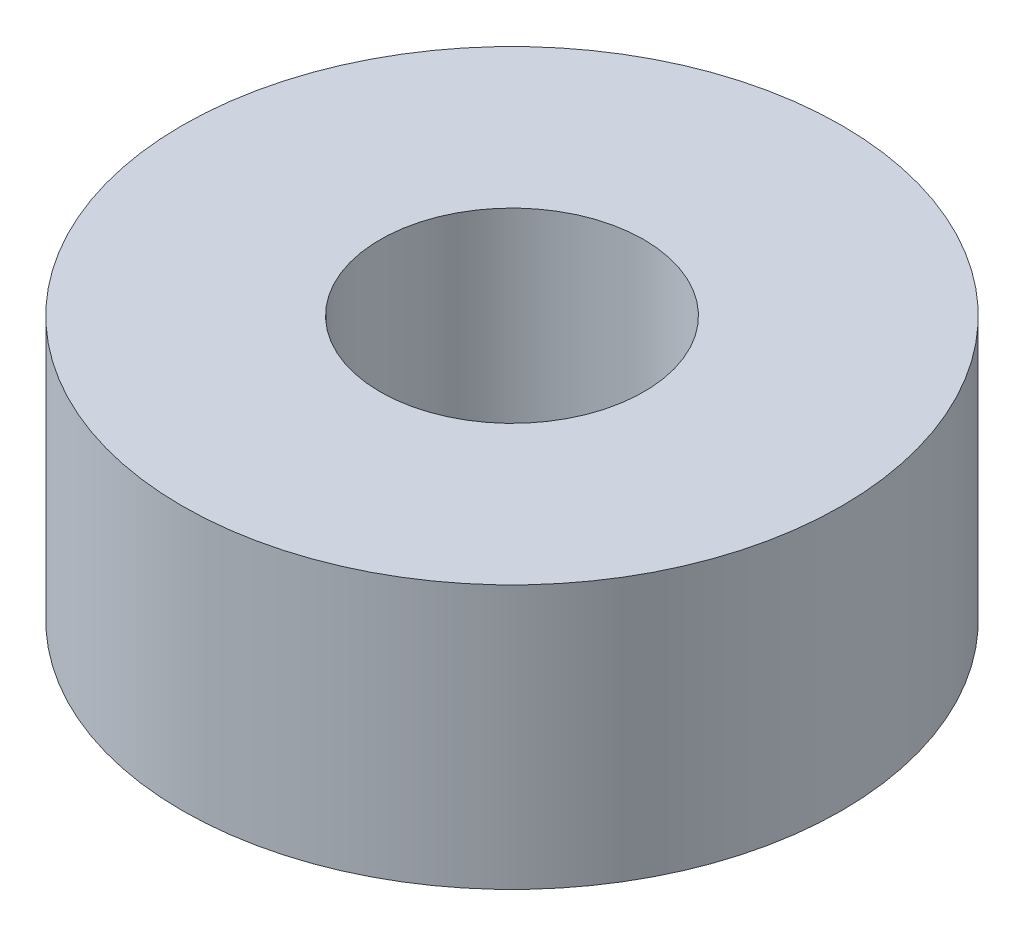
ISO-10303-21;
HEADER;
FILE_DESCRIPTION(('STEP AP214'),'2;1');
FILE_NAME('part.step','',(''),(''),'','','');
FILE_SCHEMA(('AUTOMOTIVE_DESIGN { 1 0 10303 214 1 1 1 1 }'));
ENDSEC;
DATA;
#1=APPLICATION_CONTEXT('core data for automotive mechanical design processes');
#2=APPLICATION_PROTOCOL_DEFINITION('international standard','automotive_design',2000,#1);
#3=PRODUCT_CONTEXT('',#1,'mechanical');
#4=PRODUCT('Part','Part','',(#3));
#5=PRODUCT_RELATED_PRODUCT_CATEGORY('part','',(#4));
#6=PRODUCT_DEFINITION_FORMATION('','',#4);
#7=PRODUCT_DEFINITION_CONTEXT('part definition',#1,'design');
#8=PRODUCT_DEFINITION('design','',#6,#7);
#9=PRODUCT_DEFINITION_SHAPE('','',#8);
#10=(LENGTH_UNIT() NAMED_UNIT(*) SI_UNIT(.MILLI.,.METRE.));
#11=(NAMED_UNIT(*) PLANE_ANGLE_UNIT() SI_UNIT($,.RADIAN.));
#12=(NAMED_UNIT(*) SI_UNIT($,.STERADIAN.) SOLID_ANGLE_UNIT());
#13=UNCERTAINTY_MEASURE_WITH_UNIT(LENGTH_MEASURE(1.E-05),#10,'distance_accuracy_value','');
#14=(GEOMETRIC_REPRESENTATION_CONTEXT(3) GLOBAL_UNCERTAINTY_ASSIGNED_CONTEXT((#13)) GLOBAL_UNIT_ASSIGNED_CONTEXT((#10,
#11,#12)) REPRESENTATION_CONTEXT('',''));
#15=CARTESIAN_POINT('',(0.,0.,0.));
#16=DIRECTION('',(0.,0.,1.));
#17=DIRECTION('',(1.,0.,0.));
#18=AXIS2_PLACEMENT_3D('',#15,#16,#17);
#19=CARTESIAN_POINT('',(0.,2.,0.));
#20=DIRECTION('',(0.,1.,0.));
#21=DIRECTION('',(0.,0.,1.));
#22=AXIS2_PLACEMENT_3D('',#19,#20,#21);
#23=PLANE('',#22);
#24=CARTESIAN_POINT('',(0.,2.,0.));
#25=DIRECTION('',(0.,1.,0.));
#26=DIRECTION('',(0.,0.,1.));
#27=AXIS2_PLACEMENT_3D('',#24,#25,#26);
#28=CIRCLE('',#27,2.5);
#29=CARTESIAN_POINT('',(0.,2.,2.5));
#30=VERTEX_POINT('',#29);
#31=EDGE_CURVE('E10',#30,#30,#28,.T.);
#32=ORIENTED_EDGE('',*,*,#31,.T.);
#33=EDGE_LOOP('',(#32));
#34=FACE_BOUND('',#33,.T.);
#35=CARTESIAN_POINT('',(0.,2.,0.));
#36=DIRECTION('',(0.,1.,0.));
#37=DIRECTION('',(0.,0.,1.));
#38=AXIS2_PLACEMENT_3D('',#35,#36,#37);
#39=CIRCLE('',#38,1.);
#40=CARTESIAN_POINT('',(0.,2.,1.));
#41=VERTEX_POINT('',#40);
#42=EDGE_CURVE('E42',#41,#41,#39,.T.);
#43=ORIENTED_EDGE('',*,*,#42,.F.);
#44=EDGE_LOOP('',(#43));
#45=FACE_BOUND('',#44,.T.);
#46=ADVANCED_FACE('F31',(#34,#45),#23,.T.);
#47=CARTESIAN_POINT('',(0.,0.,0.));
#48=DIRECTION('',(0.,1.,0.));
#49=DIRECTION('',(0.,0.,1.));
#50=AXIS2_PLACEMENT_3D('',#47,#48,#49);
#51=PLANE('',#50);
#52=CARTESIAN_POINT('',(0.,0.,0.));
#53=DIRECTION('',(0.,1.,0.));
#54=DIRECTION('',(0.,0.,1.));
#55=AXIS2_PLACEMENT_3D('',#52,#53,#54);
#56=CIRCLE('',#55,2.5);
#57=CARTESIAN_POINT('',(0.,0.,2.5));
#58=VERTEX_POINT('',#57);
#59=EDGE_CURVE('E35',#58,#58,#56,.T.);
#60=ORIENTED_EDGE('',*,*,#59,.F.);
#61=EDGE_LOOP('',(#60));
#62=FACE_BOUND('',#61,.T.);
#63=CARTESIAN_POINT('',(0.,0.,0.));
#64=DIRECTION('',(0.,1.,0.));
#65=DIRECTION('',(0.,0.,1.));
#66=AXIS2_PLACEMENT_3D('',#63,#64,#65);
#67=CIRCLE('',#66,1.);
#68=CARTESIAN_POINT('',(0.,0.,1.));
#69=VERTEX_POINT('',#68);
#70=EDGE_CURVE('E44',#69,#69,#67,.T.);
#71=ORIENTED_EDGE('',*,*,#70,.T.);
#72=EDGE_LOOP('',(#71));
#73=FACE_BOUND('',#72,.T.);
#74=ADVANCED_FACE('F54',(#62,#73),#51,.F.);
#75=CARTESIAN_POINT('',(0.,2.,0.));
#76=DIRECTION('',(0.,-1.,0.));
#77=DIRECTION('',(0.,0.,-1.));
#78=AXIS2_PLACEMENT_3D('',#75,#76,#77);
#79=CYLINDRICAL_SURFACE('',#78,2.5);
#80=ORIENTED_EDGE('',*,*,#31,.F.);
#81=EDGE_LOOP('',(#80));
#82=FACE_BOUND('',#81,.T.);
#83=ORIENTED_EDGE('',*,*,#59,.T.);
#84=EDGE_LOOP('',(#83));
#85=FACE_BOUND('',#84,.T.);
#86=ADVANCED_FACE('F33',(#82,#85),#79,.T.);
#87=CARTESIAN_POINT('',(0.,2.,0.));
#88=DIRECTION('',(0.,-1.,0.));
#89=DIRECTION('',(0.,0.,-1.));
#90=AXIS2_PLACEMENT_3D('',#87,#88,#89);
#91=CYLINDRICAL_SURFACE('',#90,1.);
#92=ORIENTED_EDGE('',*,*,#42,.T.);
#93=EDGE_LOOP('',(#92));
#94=FACE_BOUND('',#93,.T.);
#95=ORIENTED_EDGE('',*,*,#70,.F.);
#96=EDGE_LOOP('',(#95));
#97=FACE_BOUND('',#96,.T.);
#98=ADVANCED_FACE('F50',(#94,#97),#91,.F.);
#99=CLOSED_SHELL('',(#46,#74,#86,#98));
#100=MANIFOLD_SOLID_BREP('B2',#99);
#101=ADVANCED_BREP_SHAPE_REPRESENTATION('',(#18,#100),#14);
#102=SHAPE_DEFINITION_REPRESENTATION(#9,#101);
ENDSEC;
END-ISO-10303-21;
